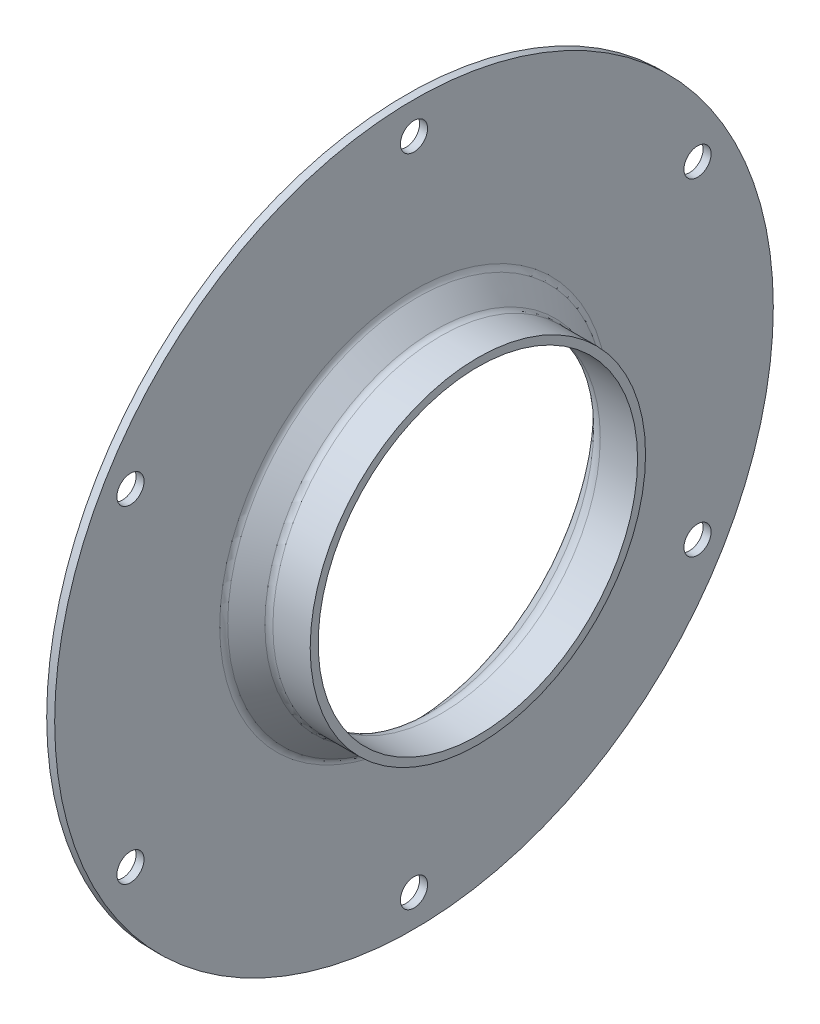
ISO-10303-21;
HEADER;
FILE_DESCRIPTION(('STEP AP214'),'2;1');
FILE_NAME('part.step','',(''),(''),'','','');
FILE_SCHEMA(('AUTOMOTIVE_DESIGN { 1 0 10303 214 1 1 1 1 }'));
ENDSEC;
DATA;
#1=APPLICATION_CONTEXT('core data for automotive mechanical design processes');
#2=APPLICATION_PROTOCOL_DEFINITION('international standard','automotive_design',2000,#1);
#3=PRODUCT_CONTEXT('',#1,'mechanical');
#4=PRODUCT('Part','Part','',(#3));
#5=PRODUCT_RELATED_PRODUCT_CATEGORY('part','',(#4));
#6=PRODUCT_DEFINITION_FORMATION('','',#4);
#7=PRODUCT_DEFINITION_CONTEXT('part definition',#1,'design');
#8=PRODUCT_DEFINITION('design','',#6,#7);
#9=PRODUCT_DEFINITION_SHAPE('','',#8);
#10=(LENGTH_UNIT() NAMED_UNIT(*) SI_UNIT(.MILLI.,.METRE.));
#11=(NAMED_UNIT(*) PLANE_ANGLE_UNIT() SI_UNIT($,.RADIAN.));
#12=(NAMED_UNIT(*) SI_UNIT($,.STERADIAN.) SOLID_ANGLE_UNIT());
#13=UNCERTAINTY_MEASURE_WITH_UNIT(LENGTH_MEASURE(1.E-05),#10,'distance_accuracy_value','');
#14=(GEOMETRIC_REPRESENTATION_CONTEXT(3) GLOBAL_UNCERTAINTY_ASSIGNED_CONTEXT((#13)) GLOBAL_UNIT_ASSIGNED_CONTEXT((#10,
#11,#12)) REPRESENTATION_CONTEXT('',''));
#15=CARTESIAN_POINT('',(0.,0.,0.));
#16=DIRECTION('',(0.,0.,1.));
#17=DIRECTION('',(1.,0.,0.));
#18=AXIS2_PLACEMENT_3D('',#15,#16,#17);
#19=CARTESIAN_POINT('',(28.3113700732,0.,0.));
#20=DIRECTION('',(1.,0.,0.));
#21=DIRECTION('',(0.,0.,-1.));
#22=AXIS2_PLACEMENT_3D('',#19,#20,#21);
#23=CYLINDRICAL_SURFACE('',#22,21.);
#24=CARTESIAN_POINT('',(37.7613700732,0.,0.));
#25=DIRECTION('',(1.,0.,0.));
#26=DIRECTION('',(0.,0.,-1.));
#27=AXIS2_PLACEMENT_3D('',#24,#25,#26);
#28=CIRCLE('',#27,21.);
#29=CARTESIAN_POINT('',(37.7613700732,0.,-21.));
#30=VERTEX_POINT('',#29);
#31=EDGE_CURVE('E152',#30,#30,#28,.T.);
#32=ORIENTED_EDGE('',*,*,#31,.F.);
#33=EDGE_LOOP('',(#32));
#34=FACE_BOUND('',#33,.T.);
#35=CARTESIAN_POINT('',(33.08979719795,0.,0.));
#36=DIRECTION('',(1.,0.,0.));
#37=DIRECTION('',(0.,-0.00717735448590776,-0.999974242459566));
#38=AXIS2_PLACEMENT_3D('',#35,#36,#37);
#39=CIRCLE('',#38,21.);
#40=CARTESIAN_POINT('',(33.08979719795,-0.150724444204063,-20.9994590916509));
#41=VERTEX_POINT('',#40);
#42=EDGE_CURVE('E155',#41,#41,#39,.T.);
#43=ORIENTED_EDGE('',*,*,#42,.T.);
#44=EDGE_LOOP('',(#43));
#45=FACE_BOUND('',#44,.T.);
#46=ADVANCED_FACE('F17',(#34,#45),#23,.T.);
#47=CARTESIAN_POINT('',(33.08979719795,0.,0.));
#48=DIRECTION('',(1.,0.,0.));
#49=DIRECTION('',(0.,-0.00717735448590776,-0.999974242459566));
#50=AXIS2_PLACEMENT_3D('',#47,#48,#49);
#51=TOROIDAL_SURFACE('',#50,22.,1.);
#52=ORIENTED_EDGE('',*,*,#42,.F.);
#53=EDGE_LOOP('',(#52));
#54=FACE_BOUND('',#53,.T.);
#55=CARTESIAN_POINT('',(32.3826904244252,0.,0.));
#56=DIRECTION('',(-1.,0.,0.));
#57=DIRECTION('',(0.,0.,1.));
#58=AXIS2_PLACEMENT_3D('',#55,#56,#57);
#59=CIRCLE('',#58,21.2928932111552);
#60=CARTESIAN_POINT('',(32.3826904244252,0.,21.2928932111552));
#61=VERTEX_POINT('',#60);
#62=EDGE_CURVE('E149',#61,#61,#59,.T.);
#63=ORIENTED_EDGE('',*,*,#62,.F.);
#64=EDGE_LOOP('',(#63));
#65=FACE_BOUND('',#64,.T.);
#66=ADVANCED_FACE('F157',(#54,#65),#51,.F.);
#67=CARTESIAN_POINT('',(37.7613700732,0.,0.));
#68=DIRECTION('',(1.,0.,0.));
#69=DIRECTION('',(0.,0.,-1.));
#70=AXIS2_PLACEMENT_3D('',#67,#68,#69);
#71=PLANE('',#70);
#72=CARTESIAN_POINT('',(37.7613700732,0.,0.));
#73=DIRECTION('',(1.,0.,0.));
#74=DIRECTION('',(0.,0.,-1.));
#75=AXIS2_PLACEMENT_3D('',#72,#73,#74);
#76=CIRCLE('',#75,20.);
#77=CARTESIAN_POINT('',(37.7613700732,0.,-20.));
#78=VERTEX_POINT('',#77);
#79=EDGE_CURVE('E148',#78,#78,#76,.F.);
#80=ORIENTED_EDGE('',*,*,#79,.T.);
#81=EDGE_LOOP('',(#80));
#82=FACE_BOUND('',#81,.T.);
#83=ORIENTED_EDGE('',*,*,#31,.T.);
#84=EDGE_LOOP('',(#83));
#85=FACE_BOUND('',#84,.T.);
#86=ADVANCED_FACE('F160',(#82,#85),#71,.T.);
#87=CARTESIAN_POINT('',(30.0542633496748,0.,0.));
#88=DIRECTION('',(-1.,0.,0.));
#89=DIRECTION('',(0.,-1.,0.));
#90=AXIS2_PLACEMENT_3D('',#87,#88,#89);
#91=CONICAL_SURFACE('',#90,23.6213202859048,0.785398163397299);
#92=ORIENTED_EDGE('',*,*,#62,.T.);
#93=EDGE_LOOP('',(#92));
#94=FACE_BOUND('',#93,.T.);
#95=CARTESIAN_POINT('',(30.0542633496735,0.,0.));
#96=DIRECTION('',(1.,0.,0.));
#97=DIRECTION('',(0.,-0.00684713306833508,-0.999976558109611));
#98=AXIS2_PLACEMENT_3D('',#95,#96,#97);
#99=CIRCLE('',#98,23.6213202859035);
#100=CARTESIAN_POINT('',(30.0542633496735,-0.161738323247344,-23.6207665575025));
#101=VERTEX_POINT('',#100);
#102=EDGE_CURVE('E145',#101,#101,#99,.T.);
#103=ORIENTED_EDGE('',*,*,#102,.T.);
#104=EDGE_LOOP('',(#103));
#105=FACE_BOUND('',#104,.T.);
#106=ADVANCED_FACE('F163',(#94,#105),#91,.T.);
#107=CARTESIAN_POINT('',(28.3113700732,0.,0.));
#108=DIRECTION('',(1.,0.,0.));
#109=DIRECTION('',(0.,0.,-1.));
#110=AXIS2_PLACEMENT_3D('',#107,#108,#109);
#111=CYLINDRICAL_SURFACE('',#110,20.);
#112=ORIENTED_EDGE('',*,*,#79,.F.);
#113=EDGE_LOOP('',(#112));
#114=FACE_BOUND('',#113,.T.);
#115=CARTESIAN_POINT('',(33.08979719795,0.,0.));
#116=DIRECTION('',(1.,0.,0.));
#117=DIRECTION('',(0.,-0.00739253266526074,0.999972674857065));
#118=AXIS2_PLACEMENT_3D('',#115,#116,#117);
#119=CIRCLE('',#118,20.);
#120=CARTESIAN_POINT('',(33.08979719795,-0.147850653305215,19.9994534971413));
#121=VERTEX_POINT('',#120);
#122=EDGE_CURVE('E55',#121,#121,#119,.T.);
#123=ORIENTED_EDGE('',*,*,#122,.F.);
#124=EDGE_LOOP('',(#123));
#125=FACE_BOUND('',#124,.T.);
#126=ADVANCED_FACE('F131',(#114,#125),#111,.F.);
#127=CARTESIAN_POINT('',(30.7613700732,0.,0.));
#128=DIRECTION('',(1.,0.,0.));
#129=DIRECTION('',(0.,-0.00684713306833508,-0.999976558109611));
#130=AXIS2_PLACEMENT_3D('',#127,#128,#129);
#131=TOROIDAL_SURFACE('',#130,24.32842712475,1.);
#132=ORIENTED_EDGE('',*,*,#102,.F.);
#133=EDGE_LOOP('',(#132));
#134=FACE_BOUND('',#133,.T.);
#135=CARTESIAN_POINT('',(29.7613700732,0.,0.));
#136=DIRECTION('',(1.,0.,0.));
#137=DIRECTION('',(0.,0.,1.));
#138=AXIS2_PLACEMENT_3D('',#135,#136,#137);
#139=CIRCLE('',#138,24.32842700584);
#140=CARTESIAN_POINT('',(29.7613700732,0.,-24.328427041513));
#141=VERTEX_POINT('',#140);
#142=CARTESIAN_POINT('',(29.7613700732,0.,24.328427041513));
#143=VERTEX_POINT('',#142);
#144=EDGE_CURVE('E42',#141,#143,#139,.F.);
#145=ORIENTED_EDGE('',*,*,#144,.F.);
#146=CARTESIAN_POINT('',(29.7613700732,0.,0.));
#147=DIRECTION('',(1.,0.,0.));
#148=DIRECTION('',(0.,0.,-1.));
#149=AXIS2_PLACEMENT_3D('',#146,#147,#148);
#150=CIRCLE('',#149,24.328427065295);
#151=EDGE_CURVE('E45',#143,#141,#150,.F.);
#152=ORIENTED_EDGE('',*,*,#151,.F.);
#153=EDGE_LOOP('',(#145,#152));
#154=FACE_BOUND('',#153,.T.);
#155=ADVANCED_FACE('F54',(#134,#154),#131,.F.);
#156=CARTESIAN_POINT('',(33.08979719795,0.,0.));
#157=DIRECTION('',(1.,0.,0.));
#158=DIRECTION('',(0.,-0.00739253266526074,0.999972674857065));
#159=AXIS2_PLACEMENT_3D('',#156,#157,#158);
#160=TOROIDAL_SURFACE('',#159,22.,2.);
#161=CARTESIAN_POINT('',(31.6755840316352,0.,0.));
#162=DIRECTION('',(-1.,0.,0.));
#163=DIRECTION('',(0.,0.,1.));
#164=AXIS2_PLACEMENT_3D('',#161,#162,#163);
#165=CIRCLE('',#164,20.5857860415652);
#166=CARTESIAN_POINT('',(31.6755840316352,0.,20.5857860415652));
#167=VERTEX_POINT('',#166);
#168=EDGE_CURVE('E51',#167,#167,#165,.T.);
#169=ORIENTED_EDGE('',*,*,#168,.T.);
#170=EDGE_LOOP('',(#169));
#171=FACE_BOUND('',#170,.T.);
#172=ORIENTED_EDGE('',*,*,#122,.T.);
#173=EDGE_LOOP('',(#172));
#174=FACE_BOUND('',#173,.T.);
#175=ADVANCED_FACE('F110',(#171,#174),#160,.T.);
#176=CARTESIAN_POINT('',(29.7613700732,0.,0.));
#177=DIRECTION('',(1.,0.,0.));
#178=DIRECTION('',(0.,0.,-1.));
#179=AXIS2_PLACEMENT_3D('',#176,#177,#178);
#180=PLANE('',#179);
#181=ORIENTED_EDGE('',*,*,#144,.T.);
#182=ORIENTED_EDGE('',*,*,#151,.T.);
#183=EDGE_LOOP('',(#181,#182));
#184=FACE_BOUND('',#183,.T.);
#185=CARTESIAN_POINT('',(29.7613700732,20.5,-35.50704155516));
#186=DIRECTION('',(1.,0.,0.));
#187=DIRECTION('',(0.,0.,-1.));
#188=AXIS2_PLACEMENT_3D('',#185,#186,#187);
#189=CIRCLE('',#188,1.7);
#190=CARTESIAN_POINT('',(29.7613700732,20.5,-37.20704155516));
#191=VERTEX_POINT('',#190);
#192=EDGE_CURVE('E96',#191,#191,#189,.F.);
#193=ORIENTED_EDGE('',*,*,#192,.T.);
#194=EDGE_LOOP('',(#193));
#195=FACE_BOUND('',#194,.T.);
#196=CARTESIAN_POINT('',(29.7613700732,41.,0.));
#197=DIRECTION('',(1.,0.,0.));
#198=DIRECTION('',(0.,0.,-1.));
#199=AXIS2_PLACEMENT_3D('',#196,#197,#198);
#200=CIRCLE('',#199,1.7);
#201=CARTESIAN_POINT('',(29.7613700732,41.,-1.7));
#202=VERTEX_POINT('',#201);
#203=EDGE_CURVE('E211',#202,#202,#200,.F.);
#204=ORIENTED_EDGE('',*,*,#203,.T.);
#205=EDGE_LOOP('',(#204));
#206=FACE_BOUND('',#205,.T.);
#207=CARTESIAN_POINT('',(29.7613700732,20.5,35.50704155516));
#208=DIRECTION('',(1.,0.,0.));
#209=DIRECTION('',(0.,0.,-1.));
#210=AXIS2_PLACEMENT_3D('',#207,#208,#209);
#211=CIRCLE('',#210,1.7);
#212=CARTESIAN_POINT('',(29.7613700732,20.5,33.80704155516));
#213=VERTEX_POINT('',#212);
#214=EDGE_CURVE('E214',#213,#213,#211,.F.);
#215=ORIENTED_EDGE('',*,*,#214,.T.);
#216=EDGE_LOOP('',(#215));
#217=FACE_BOUND('',#216,.T.);
#218=CARTESIAN_POINT('',(29.7613700732,-20.5,35.50704155516));
#219=DIRECTION('',(1.,0.,0.));
#220=DIRECTION('',(0.,0.,-1.));
#221=AXIS2_PLACEMENT_3D('',#218,#219,#220);
#222=CIRCLE('',#221,1.7);
#223=CARTESIAN_POINT('',(29.7613700732,-20.5,33.80704155516));
#224=VERTEX_POINT('',#223);
#225=EDGE_CURVE('E217',#224,#224,#222,.F.);
#226=ORIENTED_EDGE('',*,*,#225,.T.);
#227=EDGE_LOOP('',(#226));
#228=FACE_BOUND('',#227,.T.);
#229=CARTESIAN_POINT('',(29.7613700732,-41.,0.));
#230=DIRECTION('',(1.,0.,0.));
#231=DIRECTION('',(0.,0.,-1.));
#232=AXIS2_PLACEMENT_3D('',#229,#230,#231);
#233=CIRCLE('',#232,1.7);
#234=CARTESIAN_POINT('',(29.7613700732,-41.,-1.7));
#235=VERTEX_POINT('',#234);
#236=EDGE_CURVE('E220',#235,#235,#233,.F.);
#237=ORIENTED_EDGE('',*,*,#236,.T.);
#238=EDGE_LOOP('',(#237));
#239=FACE_BOUND('',#238,.T.);
#240=CARTESIAN_POINT('',(29.7613700732,-20.5,-35.50704155516));
#241=DIRECTION('',(1.,0.,0.));
#242=DIRECTION('',(0.,0.,-1.));
#243=AXIS2_PLACEMENT_3D('',#240,#241,#242);
#244=CIRCLE('',#243,1.7);
#245=CARTESIAN_POINT('',(29.7613700732,-20.5,-37.20704155516));
#246=VERTEX_POINT('',#245);
#247=EDGE_CURVE('E223',#246,#246,#244,.F.);
#248=ORIENTED_EDGE('',*,*,#247,.T.);
#249=EDGE_LOOP('',(#248));
#250=FACE_BOUND('',#249,.T.);
#251=CARTESIAN_POINT('',(29.7613700732,0.,0.));
#252=DIRECTION('',(1.,0.,0.));
#253=DIRECTION('',(0.,0.,-1.));
#254=AXIS2_PLACEMENT_3D('',#251,#252,#253);
#255=CIRCLE('',#254,45.);
#256=CARTESIAN_POINT('',(29.7613700732,0.,-45.));
#257=VERTEX_POINT('',#256);
#258=EDGE_CURVE('E123',#257,#257,#255,.F.);
#259=ORIENTED_EDGE('',*,*,#258,.F.);
#260=EDGE_LOOP('',(#259));
#261=FACE_BOUND('',#260,.T.);
#262=ADVANCED_FACE('F47',(#184,#195,#206,#217,#228,#239,#250,#261),#180,.T.);
#263=CARTESIAN_POINT('',(29.3471568416898,0.,0.));
#264=DIRECTION('',(-1.,0.,0.));
#265=DIRECTION('',(0.,-1.,0.));
#266=AXIS2_PLACEMENT_3D('',#263,#264,#265);
#267=CONICAL_SURFACE('',#266,22.9142132315098,0.785398163397299);
#268=ORIENTED_EDGE('',*,*,#168,.F.);
#269=EDGE_LOOP('',(#268));
#270=FACE_BOUND('',#269,.T.);
#271=CARTESIAN_POINT('',(29.3471568416919,0.,0.));
#272=DIRECTION('',(1.,0.,0.));
#273=DIRECTION('',(0.,-0.00679774074924324,0.999976895093435));
#274=AXIS2_PLACEMENT_3D('',#271,#272,#273);
#275=CIRCLE('',#274,22.9142132315119);
#276=CARTESIAN_POINT('',(29.3471568416919,-0.155764881020697,22.9136838007562));
#277=VERTEX_POINT('',#276);
#278=EDGE_CURVE('E88',#277,#277,#275,.T.);
#279=ORIENTED_EDGE('',*,*,#278,.F.);
#280=EDGE_LOOP('',(#279));
#281=FACE_BOUND('',#280,.T.);
#282=ADVANCED_FACE('F109',(#270,#281),#267,.F.);
#283=CARTESIAN_POINT('',(28.3113700732,0.,0.));
#284=DIRECTION('',(1.,0.,0.));
#285=DIRECTION('',(0.,0.,-1.));
#286=AXIS2_PLACEMENT_3D('',#283,#284,#285);
#287=CYLINDRICAL_SURFACE('',#286,45.);
#288=ORIENTED_EDGE('',*,*,#258,.T.);
#289=EDGE_LOOP('',(#288));
#290=FACE_BOUND('',#289,.T.);
#291=CARTESIAN_POINT('',(28.7613700732,0.,0.));
#292=DIRECTION('',(1.,0.,0.));
#293=DIRECTION('',(0.,0.,-1.));
#294=AXIS2_PLACEMENT_3D('',#291,#292,#293);
#295=CIRCLE('',#294,45.);
#296=CARTESIAN_POINT('',(28.7613700732,0.,-45.));
#297=VERTEX_POINT('',#296);
#298=EDGE_CURVE('E95',#297,#297,#295,.T.);
#299=ORIENTED_EDGE('',*,*,#298,.T.);
#300=EDGE_LOOP('',(#299));
#301=FACE_BOUND('',#300,.T.);
#302=ADVANCED_FACE('F293',(#290,#301),#287,.T.);
#303=CARTESIAN_POINT('',(29.7613700732,-20.5,-35.50704155516));
#304=DIRECTION('',(1.,0.,0.));
#305=DIRECTION('',(0.,0.,-1.));
#306=AXIS2_PLACEMENT_3D('',#303,#304,#305);
#307=CYLINDRICAL_SURFACE('',#306,1.7);
#308=ORIENTED_EDGE('',*,*,#247,.F.);
#309=EDGE_LOOP('',(#308));
#310=FACE_BOUND('',#309,.T.);
#311=CARTESIAN_POINT('',(28.7613700732,-20.5,-35.50704155516));
#312=DIRECTION('',(1.,0.,0.));
#313=DIRECTION('',(0.,0.,-1.));
#314=AXIS2_PLACEMENT_3D('',#311,#312,#313);
#315=CIRCLE('',#314,1.7);
#316=CARTESIAN_POINT('',(28.7613700732,-20.5,-37.20704155516));
#317=VERTEX_POINT('',#316);
#318=EDGE_CURVE('E201',#317,#317,#315,.F.);
#319=ORIENTED_EDGE('',*,*,#318,.T.);
#320=EDGE_LOOP('',(#319));
#321=FACE_BOUND('',#320,.T.);
#322=ADVANCED_FACE('F302',(#310,#321),#307,.F.);
#323=CARTESIAN_POINT('',(29.7613700732,-41.,0.));
#324=DIRECTION('',(1.,0.,0.));
#325=DIRECTION('',(0.,0.,-1.));
#326=AXIS2_PLACEMENT_3D('',#323,#324,#325);
#327=CYLINDRICAL_SURFACE('',#326,1.7);
#328=ORIENTED_EDGE('',*,*,#236,.F.);
#329=EDGE_LOOP('',(#328));
#330=FACE_BOUND('',#329,.T.);
#331=CARTESIAN_POINT('',(28.7613700732,-41.,0.));
#332=DIRECTION('',(1.,0.,0.));
#333=DIRECTION('',(0.,0.,-1.));
#334=AXIS2_PLACEMENT_3D('',#331,#332,#333);
#335=CIRCLE('',#334,1.7);
#336=CARTESIAN_POINT('',(28.7613700732,-41.,-1.7));
#337=VERTEX_POINT('',#336);
#338=EDGE_CURVE('E197',#337,#337,#335,.F.);
#339=ORIENTED_EDGE('',*,*,#338,.T.);
#340=EDGE_LOOP('',(#339));
#341=FACE_BOUND('',#340,.T.);
#342=ADVANCED_FACE('F311',(#330,#341),#327,.F.);
#343=CARTESIAN_POINT('',(29.7613700732,-20.5,35.50704155516));
#344=DIRECTION('',(1.,0.,0.));
#345=DIRECTION('',(0.,0.,-1.));
#346=AXIS2_PLACEMENT_3D('',#343,#344,#345);
#347=CYLINDRICAL_SURFACE('',#346,1.7);
#348=ORIENTED_EDGE('',*,*,#225,.F.);
#349=EDGE_LOOP('',(#348));
#350=FACE_BOUND('',#349,.T.);
#351=CARTESIAN_POINT('',(28.7613700732,-20.5,35.50704155516));
#352=DIRECTION('',(1.,0.,0.));
#353=DIRECTION('',(0.,0.,-1.));
#354=AXIS2_PLACEMENT_3D('',#351,#352,#353);
#355=CIRCLE('',#354,1.7);
#356=CARTESIAN_POINT('',(28.7613700732,-20.5,33.80704155516));
#357=VERTEX_POINT('',#356);
#358=EDGE_CURVE('E193',#357,#357,#355,.F.);
#359=ORIENTED_EDGE('',*,*,#358,.T.);
#360=EDGE_LOOP('',(#359));
#361=FACE_BOUND('',#360,.T.);
#362=ADVANCED_FACE('F321',(#350,#361),#347,.F.);
#363=CARTESIAN_POINT('',(29.7613700732,20.5,35.50704155516));
#364=DIRECTION('',(1.,0.,0.));
#365=DIRECTION('',(0.,0.,-1.));
#366=AXIS2_PLACEMENT_3D('',#363,#364,#365);
#367=CYLINDRICAL_SURFACE('',#366,1.7);
#368=ORIENTED_EDGE('',*,*,#214,.F.);
#369=EDGE_LOOP('',(#368));
#370=FACE_BOUND('',#369,.T.);
#371=CARTESIAN_POINT('',(28.7613700732,20.5,35.50704155516));
#372=DIRECTION('',(1.,0.,0.));
#373=DIRECTION('',(0.,0.,-1.));
#374=AXIS2_PLACEMENT_3D('',#371,#372,#373);
#375=CIRCLE('',#374,1.7);
#376=CARTESIAN_POINT('',(28.7613700732,20.5,33.80704155516));
#377=VERTEX_POINT('',#376);
#378=EDGE_CURVE('E189',#377,#377,#375,.F.);
#379=ORIENTED_EDGE('',*,*,#378,.T.);
#380=EDGE_LOOP('',(#379));
#381=FACE_BOUND('',#380,.T.);
#382=ADVANCED_FACE('F331',(#370,#381),#367,.F.);
#383=CARTESIAN_POINT('',(29.7613700732,41.,0.));
#384=DIRECTION('',(1.,0.,0.));
#385=DIRECTION('',(0.,0.,-1.));
#386=AXIS2_PLACEMENT_3D('',#383,#384,#385);
#387=CYLINDRICAL_SURFACE('',#386,1.7);
#388=ORIENTED_EDGE('',*,*,#203,.F.);
#389=EDGE_LOOP('',(#388));
#390=FACE_BOUND('',#389,.T.);
#391=CARTESIAN_POINT('',(28.7613700732,41.,0.));
#392=DIRECTION('',(1.,0.,0.));
#393=DIRECTION('',(0.,0.,-1.));
#394=AXIS2_PLACEMENT_3D('',#391,#392,#393);
#395=CIRCLE('',#394,1.7);
#396=CARTESIAN_POINT('',(28.7613700732,41.,-1.7));
#397=VERTEX_POINT('',#396);
#398=EDGE_CURVE('E185',#397,#397,#395,.F.);
#399=ORIENTED_EDGE('',*,*,#398,.T.);
#400=EDGE_LOOP('',(#399));
#401=FACE_BOUND('',#400,.T.);
#402=ADVANCED_FACE('F341',(#390,#401),#387,.F.);
#403=CARTESIAN_POINT('',(29.7613700732,20.5,-35.50704155516));
#404=DIRECTION('',(1.,0.,0.));
#405=DIRECTION('',(0.,0.,-1.));
#406=AXIS2_PLACEMENT_3D('',#403,#404,#405);
#407=CYLINDRICAL_SURFACE('',#406,1.7);
#408=ORIENTED_EDGE('',*,*,#192,.F.);
#409=EDGE_LOOP('',(#408));
#410=FACE_BOUND('',#409,.T.);
#411=CARTESIAN_POINT('',(28.7613700732,20.5,-35.50704155516));
#412=DIRECTION('',(1.,0.,0.));
#413=DIRECTION('',(0.,0.,-1.));
#414=AXIS2_PLACEMENT_3D('',#411,#412,#413);
#415=CIRCLE('',#414,1.7);
#416=CARTESIAN_POINT('',(28.7613700732,20.5,-37.20704155516));
#417=VERTEX_POINT('',#416);
#418=EDGE_CURVE('E181',#417,#417,#415,.F.);
#419=ORIENTED_EDGE('',*,*,#418,.T.);
#420=EDGE_LOOP('',(#419));
#421=FACE_BOUND('',#420,.T.);
#422=ADVANCED_FACE('F74',(#410,#421),#407,.F.);
#423=CARTESIAN_POINT('',(30.7613700732,0.,0.));
#424=DIRECTION('',(1.,0.,0.));
#425=DIRECTION('',(0.,-0.00679774074924324,0.999976895093435));
#426=AXIS2_PLACEMENT_3D('',#423,#424,#425);
#427=TOROIDAL_SURFACE('',#426,24.32842712475,2.);
#428=CARTESIAN_POINT('',(28.7613700732001,0.,0.));
#429=DIRECTION('',(-1.,0.,0.));
#430=DIRECTION('',(0.,0.,-1.));
#431=AXIS2_PLACEMENT_3D('',#428,#429,#430);
#432=CIRCLE('',#431,24.32842641212);
#433=CARTESIAN_POINT('',(28.7613700732,0.,-24.328426625909));
#434=VERTEX_POINT('',#433);
#435=CARTESIAN_POINT('',(28.7613700732,0.,24.328426625909));
#436=VERTEX_POINT('',#435);
#437=EDGE_CURVE('E28',#434,#436,#432,.T.);
#438=ORIENTED_EDGE('',*,*,#437,.T.);
#439=CARTESIAN_POINT('',(28.7613700732,0.,0.));
#440=DIRECTION('',(-1.,0.,0.));
#441=DIRECTION('',(0.,0.,1.));
#442=AXIS2_PLACEMENT_3D('',#439,#440,#441);
#443=CIRCLE('',#442,24.328426768435);
#444=EDGE_CURVE('E11',#436,#434,#443,.T.);
#445=ORIENTED_EDGE('',*,*,#444,.T.);
#446=EDGE_LOOP('',(#438,#445));
#447=FACE_BOUND('',#446,.T.);
#448=ORIENTED_EDGE('',*,*,#278,.T.);
#449=EDGE_LOOP('',(#448));
#450=FACE_BOUND('',#449,.T.);
#451=ADVANCED_FACE('F62',(#447,#450),#427,.T.);
#452=CARTESIAN_POINT('',(28.7613700732,0.,0.));
#453=DIRECTION('',(1.,0.,0.));
#454=DIRECTION('',(0.,0.,-1.));
#455=AXIS2_PLACEMENT_3D('',#452,#453,#454);
#456=PLANE('',#455);
#457=ORIENTED_EDGE('',*,*,#437,.F.);
#458=ORIENTED_EDGE('',*,*,#444,.F.);
#459=EDGE_LOOP('',(#457,#458));
#460=FACE_BOUND('',#459,.T.);
#461=ORIENTED_EDGE('',*,*,#418,.F.);
#462=EDGE_LOOP('',(#461));
#463=FACE_BOUND('',#462,.T.);
#464=ORIENTED_EDGE('',*,*,#398,.F.);
#465=EDGE_LOOP('',(#464));
#466=FACE_BOUND('',#465,.T.);
#467=ORIENTED_EDGE('',*,*,#378,.F.);
#468=EDGE_LOOP('',(#467));
#469=FACE_BOUND('',#468,.T.);
#470=ORIENTED_EDGE('',*,*,#358,.F.);
#471=EDGE_LOOP('',(#470));
#472=FACE_BOUND('',#471,.T.);
#473=ORIENTED_EDGE('',*,*,#338,.F.);
#474=EDGE_LOOP('',(#473));
#475=FACE_BOUND('',#474,.T.);
#476=ORIENTED_EDGE('',*,*,#318,.F.);
#477=EDGE_LOOP('',(#476));
#478=FACE_BOUND('',#477,.T.);
#479=ORIENTED_EDGE('',*,*,#298,.F.);
#480=EDGE_LOOP('',(#479));
#481=FACE_BOUND('',#480,.T.);
#482=ADVANCED_FACE('F73',(#460,#463,#466,#469,#472,#475,#478,#481),#456,.F.);
#483=CLOSED_SHELL('',(#46,#66,#86,#106,#126,#155,#175,#262,#282,#302,#322,#342,#362,#382,#402,
#422,#451,#482));
#484=MANIFOLD_SOLID_BREP('B1',#483);
#485=ADVANCED_BREP_SHAPE_REPRESENTATION('',(#18,#484),#14);
#486=SHAPE_DEFINITION_REPRESENTATION(#9,#485);
ENDSEC;
END-ISO-10303-21;
